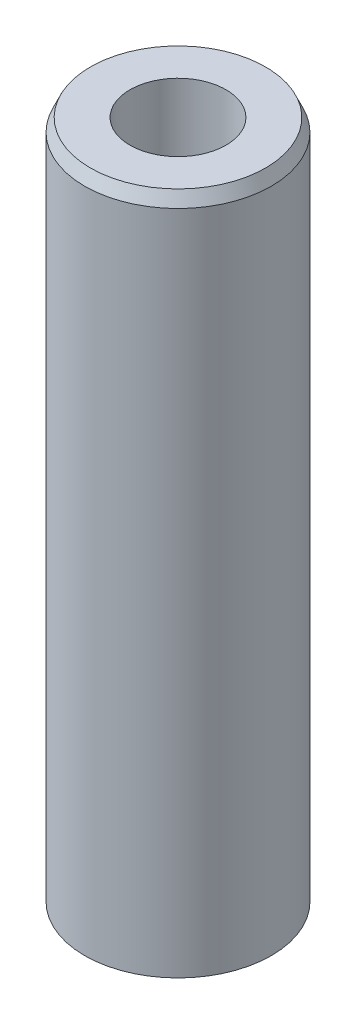
ISO-10303-21;
HEADER;
FILE_DESCRIPTION(('STEP AP214'),'2;1');
FILE_NAME('part.step','',(''),(''),'','','');
FILE_SCHEMA(('AUTOMOTIVE_DESIGN { 1 0 10303 214 1 1 1 1 }'));
ENDSEC;
DATA;
#1=APPLICATION_CONTEXT('core data for automotive mechanical design processes');
#2=APPLICATION_PROTOCOL_DEFINITION('international standard','automotive_design',2000,#1);
#3=PRODUCT_CONTEXT('',#1,'mechanical');
#4=PRODUCT('Part','Part','',(#3));
#5=PRODUCT_RELATED_PRODUCT_CATEGORY('part','',(#4));
#6=PRODUCT_DEFINITION_FORMATION('','',#4);
#7=PRODUCT_DEFINITION_CONTEXT('part definition',#1,'design');
#8=PRODUCT_DEFINITION('design','',#6,#7);
#9=PRODUCT_DEFINITION_SHAPE('','',#8);
#10=(LENGTH_UNIT() NAMED_UNIT(*) SI_UNIT(.MILLI.,.METRE.));
#11=(NAMED_UNIT(*) PLANE_ANGLE_UNIT() SI_UNIT($,.RADIAN.));
#12=(NAMED_UNIT(*) SI_UNIT($,.STERADIAN.) SOLID_ANGLE_UNIT());
#13=UNCERTAINTY_MEASURE_WITH_UNIT(LENGTH_MEASURE(1.E-05),#10,'distance_accuracy_value','');
#14=(GEOMETRIC_REPRESENTATION_CONTEXT(3) GLOBAL_UNCERTAINTY_ASSIGNED_CONTEXT((#13)) GLOBAL_UNIT_ASSIGNED_CONTEXT((#10,
#11,#12)) REPRESENTATION_CONTEXT('',''));
#15=CARTESIAN_POINT('',(0.,0.,0.));
#16=DIRECTION('',(0.,0.,1.));
#17=DIRECTION('',(1.,0.,0.));
#18=AXIS2_PLACEMENT_3D('',#15,#16,#17);
#19=CARTESIAN_POINT('',(0.,36.6990474794801,0.));
#20=DIRECTION('',(0.,-1.,0.));
#21=DIRECTION('',(0.,0.,-1.));
#22=AXIS2_PLACEMENT_3D('',#19,#20,#21);
#23=CYLINDRICAL_SURFACE('',#22,5.);
#24=CARTESIAN_POINT('',(0.,36.0076419780518,0.));
#25=DIRECTION('',(0.,1.,0.));
#26=DIRECTION('',(0.,0.,1.));
#27=AXIS2_PLACEMENT_3D('',#24,#25,#26);
#28=CIRCLE('',#27,5.);
#29=CARTESIAN_POINT('',(0.,36.0076419780518,5.));
#30=VERTEX_POINT('',#29);
#31=EDGE_CURVE('E50',#30,#30,#28,.F.);
#32=ORIENTED_EDGE('',*,*,#31,.T.);
#33=EDGE_LOOP('',(#32));
#34=FACE_BOUND('',#33,.T.);
#35=CARTESIAN_POINT('',(0.,0.307802333002066,0.));
#36=DIRECTION('',(0.,1.,0.));
#37=DIRECTION('',(0.,0.,1.));
#38=AXIS2_PLACEMENT_3D('',#35,#36,#37);
#39=CIRCLE('',#38,5.);
#40=CARTESIAN_POINT('',(0.,0.307802333002066,5.));
#41=VERTEX_POINT('',#40);
#42=EDGE_CURVE('E51',#41,#41,#39,.T.);
#43=ORIENTED_EDGE('',*,*,#42,.T.);
#44=EDGE_LOOP('',(#43));
#45=FACE_BOUND('',#44,.T.);
#46=ADVANCED_FACE('F39',(#34,#45),#23,.T.);
#47=CARTESIAN_POINT('',(0.,36.6990474794801,0.));
#48=DIRECTION('',(0.,1.,0.));
#49=DIRECTION('',(0.,0.,1.));
#50=AXIS2_PLACEMENT_3D('',#47,#48,#49);
#51=PLANE('',#50);
#52=CARTESIAN_POINT('',(0.,36.6990474794801,0.));
#53=DIRECTION('',(0.,1.,0.));
#54=DIRECTION('',(0.,0.,1.));
#55=AXIS2_PLACEMENT_3D('',#52,#53,#54);
#56=CIRCLE('',#55,4.69219766699793);
#57=CARTESIAN_POINT('',(0.,36.6990474794801,4.69219766699793));
#58=VERTEX_POINT('',#57);
#59=EDGE_CURVE('E54',#58,#58,#56,.T.);
#60=ORIENTED_EDGE('',*,*,#59,.T.);
#61=EDGE_LOOP('',(#60));
#62=FACE_BOUND('',#61,.T.);
#63=CARTESIAN_POINT('',(0.,36.6990474794801,0.));
#64=DIRECTION('',(0.,1.,0.));
#65=DIRECTION('',(0.,0.,1.));
#66=AXIS2_PLACEMENT_3D('',#63,#64,#65);
#67=CIRCLE('',#66,2.57437986625629);
#68=CARTESIAN_POINT('',(0.,36.6990474794801,2.57437986625629));
#69=VERTEX_POINT('',#68);
#70=EDGE_CURVE('E58',#69,#69,#67,.T.);
#71=ORIENTED_EDGE('',*,*,#70,.F.);
#72=EDGE_LOOP('',(#71));
#73=FACE_BOUND('',#72,.T.);
#74=ADVANCED_FACE('F69',(#62,#73),#51,.T.);
#75=CARTESIAN_POINT('',(0.,0.,0.));
#76=DIRECTION('',(0.,1.,0.));
#77=DIRECTION('',(0.,0.,1.));
#78=AXIS2_PLACEMENT_3D('',#75,#76,#77);
#79=PLANE('',#78);
#80=CARTESIAN_POINT('',(0.,0.,0.));
#81=DIRECTION('',(0.,1.,0.));
#82=DIRECTION('',(0.,0.,1.));
#83=AXIS2_PLACEMENT_3D('',#80,#81,#82);
#84=CIRCLE('',#83,4.30859449857172);
#85=CARTESIAN_POINT('',(0.,0.,4.30859449857172));
#86=VERTEX_POINT('',#85);
#87=EDGE_CURVE('E10',#86,#86,#84,.F.);
#88=ORIENTED_EDGE('',*,*,#87,.T.);
#89=EDGE_LOOP('',(#88));
#90=FACE_BOUND('',#89,.T.);
#91=CARTESIAN_POINT('',(0.,0.,0.));
#92=DIRECTION('',(0.,1.,0.));
#93=DIRECTION('',(0.,0.,1.));
#94=AXIS2_PLACEMENT_3D('',#91,#92,#93);
#95=CIRCLE('',#94,2.57437986625629);
#96=CARTESIAN_POINT('',(0.,0.,2.57437986625629));
#97=VERTEX_POINT('',#96);
#98=EDGE_CURVE('E63',#97,#97,#95,.T.);
#99=ORIENTED_EDGE('',*,*,#98,.T.);
#100=EDGE_LOOP('',(#99));
#101=FACE_BOUND('',#100,.T.);
#102=ADVANCED_FACE('F75',(#90,#101),#79,.F.);
#103=CARTESIAN_POINT('',(0.,36.6990474794801,0.));
#104=DIRECTION('',(0.,-1.,0.));
#105=DIRECTION('',(0.,0.,-1.));
#106=AXIS2_PLACEMENT_3D('',#103,#104,#105);
#107=CYLINDRICAL_SURFACE('',#106,2.57437986625629);
#108=ORIENTED_EDGE('',*,*,#70,.T.);
#109=EDGE_LOOP('',(#108));
#110=FACE_BOUND('',#109,.T.);
#111=ORIENTED_EDGE('',*,*,#98,.F.);
#112=EDGE_LOOP('',(#111));
#113=FACE_BOUND('',#112,.T.);
#114=ADVANCED_FACE('F70',(#110,#113),#107,.F.);
#115=CARTESIAN_POINT('',(0.,36.6990474794801,0.));
#116=DIRECTION('',(0.,-1.,0.));
#117=DIRECTION('',(0.,0.,-1.));
#118=AXIS2_PLACEMENT_3D('',#115,#116,#117);
#119=CONICAL_SURFACE('',#118,4.69219766699793,0.418841324188009);
#120=ORIENTED_EDGE('',*,*,#31,.F.);
#121=EDGE_LOOP('',(#120));
#122=FACE_BOUND('',#121,.T.);
#123=ORIENTED_EDGE('',*,*,#59,.F.);
#124=EDGE_LOOP('',(#123));
#125=FACE_BOUND('',#124,.T.);
#126=ADVANCED_FACE('F81',(#122,#125),#119,.T.);
#127=CARTESIAN_POINT('',(0.,0.307802333002066,0.));
#128=DIRECTION('',(0.,1.,0.));
#129=DIRECTION('',(0.,0.,1.));
#130=AXIS2_PLACEMENT_3D('',#127,#128,#129);
#131=CONICAL_SURFACE('',#130,5.,1.15195500260689);
#132=ORIENTED_EDGE('',*,*,#87,.F.);
#133=EDGE_LOOP('',(#132));
#134=FACE_BOUND('',#133,.T.);
#135=ORIENTED_EDGE('',*,*,#42,.F.);
#136=EDGE_LOOP('',(#135));
#137=FACE_BOUND('',#136,.T.);
#138=ADVANCED_FACE('F45',(#134,#137),#131,.T.);
#139=CLOSED_SHELL('',(#46,#74,#102,#114,#126,#138));
#140=MANIFOLD_SOLID_BREP('B2',#139);
#141=ADVANCED_BREP_SHAPE_REPRESENTATION('',(#18,#140),#14);
#142=SHAPE_DEFINITION_REPRESENTATION(#9,#141);
ENDSEC;
END-ISO-10303-21;
